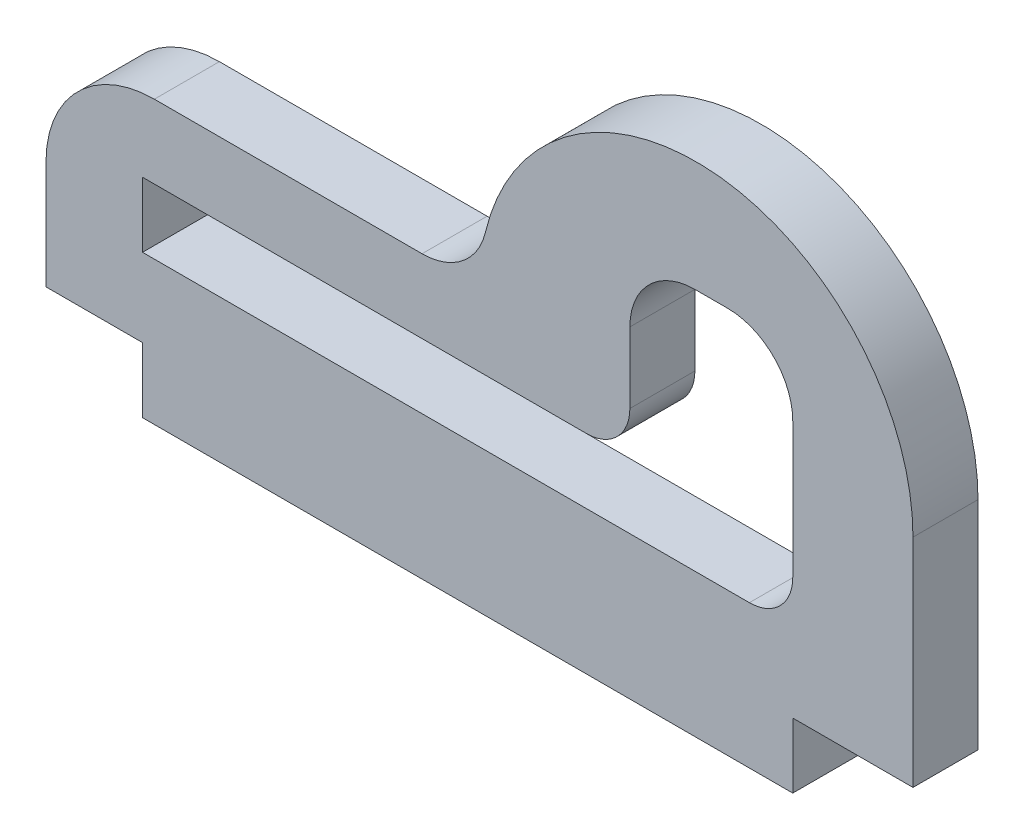
ISO-10303-21;
HEADER;
FILE_DESCRIPTION(('STEP AP214'),'2;1');
FILE_NAME('part.step','',(''),(''),'','','');
FILE_SCHEMA(('AUTOMOTIVE_DESIGN { 1 0 10303 214 1 1 1 1 }'));
ENDSEC;
DATA;
#1=APPLICATION_CONTEXT('core data for automotive mechanical design processes');
#2=APPLICATION_PROTOCOL_DEFINITION('international standard','automotive_design',2000,#1);
#3=PRODUCT_CONTEXT('',#1,'mechanical');
#4=PRODUCT('Part','Part','',(#3));
#5=PRODUCT_RELATED_PRODUCT_CATEGORY('part','',(#4));
#6=PRODUCT_DEFINITION_FORMATION('','',#4);
#7=PRODUCT_DEFINITION_CONTEXT('part definition',#1,'design');
#8=PRODUCT_DEFINITION('design','',#6,#7);
#9=PRODUCT_DEFINITION_SHAPE('','',#8);
#10=(LENGTH_UNIT() NAMED_UNIT(*) SI_UNIT(.MILLI.,.METRE.));
#11=(NAMED_UNIT(*) PLANE_ANGLE_UNIT() SI_UNIT($,.RADIAN.));
#12=(NAMED_UNIT(*) SI_UNIT($,.STERADIAN.) SOLID_ANGLE_UNIT());
#13=UNCERTAINTY_MEASURE_WITH_UNIT(LENGTH_MEASURE(1.E-05),#10,'distance_accuracy_value','');
#14=(GEOMETRIC_REPRESENTATION_CONTEXT(3) GLOBAL_UNCERTAINTY_ASSIGNED_CONTEXT((#13)) GLOBAL_UNIT_ASSIGNED_CONTEXT((#10,
#11,#12)) REPRESENTATION_CONTEXT('',''));
#15=CARTESIAN_POINT('',(0.,0.,0.));
#16=DIRECTION('',(0.,0.,1.));
#17=DIRECTION('',(1.,0.,0.));
#18=AXIS2_PLACEMENT_3D('',#15,#16,#17);
#19=CARTESIAN_POINT('',(10.,0.,3.));
#20=DIRECTION('',(0.,0.,1.));
#21=DIRECTION('',(1.,0.,0.));
#22=AXIS2_PLACEMENT_3D('',#19,#20,#21);
#23=PLANE('',#22);
#24=CARTESIAN_POINT('',(10.,0.,3.));
#25=DIRECTION('',(0.,0.,1.));
#26=DIRECTION('',(1.,0.,0.));
#27=AXIS2_PLACEMENT_3D('',#24,#25,#26);
#28=CIRCLE('',#27,10.);
#29=CARTESIAN_POINT('',(20.,0.,3.));
#30=VERTEX_POINT('',#29);
#31=CARTESIAN_POINT('',(0.269914891789601,2.30769230769231,3.));
#32=VERTEX_POINT('',#31);
#33=EDGE_CURVE('E291',#30,#32,#28,.T.);
#34=ORIENTED_EDGE('',*,*,#33,.T.);
#35=CARTESIAN_POINT('',(-2.64911064067352,3.,3.));
#36=DIRECTION('',(0.,0.,-1.));
#37=DIRECTION('',(1.,0.,0.));
#38=AXIS2_PLACEMENT_3D('',#35,#36,#37);
#39=CIRCLE('',#38,3.);
#40=CARTESIAN_POINT('',(-2.64911064067352,0.,3.));
#41=VERTEX_POINT('',#40);
#42=EDGE_CURVE('E295',#32,#41,#39,.T.);
#43=ORIENTED_EDGE('',*,*,#42,.T.);
#44=DIRECTION('',(-1.,0.,0.));
#45=VECTOR('',#44,1.);
#46=CARTESIAN_POINT('',(-2.64911064067352,0.,3.));
#47=LINE('',#46,#45);
#48=CARTESIAN_POINT('',(-15.,0.,3.));
#49=VERTEX_POINT('',#48);
#50=EDGE_CURVE('E299',#41,#49,#47,.T.);
#51=ORIENTED_EDGE('',*,*,#50,.T.);
#52=CARTESIAN_POINT('',(-15.,-5.,3.));
#53=DIRECTION('',(0.,0.,1.));
#54=DIRECTION('',(1.,0.,0.));
#55=AXIS2_PLACEMENT_3D('',#52,#53,#54);
#56=CIRCLE('',#55,5.);
#57=CARTESIAN_POINT('',(-20.,-5.00000000000004,3.));
#58=VERTEX_POINT('',#57);
#59=EDGE_CURVE('E302',#49,#58,#56,.T.);
#60=ORIENTED_EDGE('',*,*,#59,.T.);
#61=DIRECTION('',(0.,-1.,0.));
#62=VECTOR('',#61,1.);
#63=CARTESIAN_POINT('',(-20.,-5.00000000000004,3.));
#64=LINE('',#63,#62);
#65=CARTESIAN_POINT('',(-20.,-10.,3.));
#66=VERTEX_POINT('',#65);
#67=EDGE_CURVE('E305',#58,#66,#64,.T.);
#68=ORIENTED_EDGE('',*,*,#67,.T.);
#69=DIRECTION('',(1.,0.,0.));
#70=VECTOR('',#69,1.);
#71=CARTESIAN_POINT('',(-20.,-10.,3.));
#72=LINE('',#71,#70);
#73=CARTESIAN_POINT('',(-15.5468227424749,-10.,3.));
#74=VERTEX_POINT('',#73);
#75=EDGE_CURVE('E308',#66,#74,#72,.T.);
#76=ORIENTED_EDGE('',*,*,#75,.T.);
#77=DIRECTION('',(0.,-1.,0.));
#78=VECTOR('',#77,1.);
#79=CARTESIAN_POINT('',(-15.5468227424749,-10.,3.));
#80=LINE('',#79,#78);
#81=CARTESIAN_POINT('',(-15.5468227424749,-13.,3.));
#82=VERTEX_POINT('',#81);
#83=EDGE_CURVE('E311',#74,#82,#80,.T.);
#84=ORIENTED_EDGE('',*,*,#83,.T.);
#85=DIRECTION('',(1.,0.,0.));
#86=VECTOR('',#85,1.);
#87=CARTESIAN_POINT('',(-15.5468227424749,-13.,3.));
#88=LINE('',#87,#86);
#89=CARTESIAN_POINT('',(14.4531772575251,-13.,3.));
#90=VERTEX_POINT('',#89);
#91=EDGE_CURVE('E314',#82,#90,#88,.T.);
#92=ORIENTED_EDGE('',*,*,#91,.T.);
#93=DIRECTION('',(0.,1.,0.));
#94=VECTOR('',#93,1.);
#95=CARTESIAN_POINT('',(14.4531772575251,-10.,3.));
#96=LINE('',#95,#94);
#97=CARTESIAN_POINT('',(14.4531772575251,-10.,3.));
#98=VERTEX_POINT('',#97);
#99=EDGE_CURVE('E317',#90,#98,#96,.T.);
#100=ORIENTED_EDGE('',*,*,#99,.T.);
#101=DIRECTION('',(1.,0.,0.));
#102=VECTOR('',#101,1.);
#103=CARTESIAN_POINT('',(14.4531772575251,-10.,3.));
#104=LINE('',#103,#102);
#105=CARTESIAN_POINT('',(20.,-10.,3.));
#106=VERTEX_POINT('',#105);
#107=EDGE_CURVE('E320',#98,#106,#104,.T.);
#108=ORIENTED_EDGE('',*,*,#107,.T.);
#109=DIRECTION('',(0.,1.,0.));
#110=VECTOR('',#109,1.);
#111=CARTESIAN_POINT('',(20.,-10.,3.));
#112=LINE('',#111,#110);
#113=EDGE_CURVE('E323',#106,#30,#112,.T.);
#114=ORIENTED_EDGE('',*,*,#113,.T.);
#115=EDGE_LOOP('',(#34,#43,#51,#60,#68,#76,#84,#92,#100,#108,#114));
#116=FACE_BOUND('',#115,.T.);
#117=DIRECTION('',(-1.,0.,0.));
#118=VECTOR('',#117,1.);
#119=CARTESIAN_POINT('',(11.4531772575251,4.86956521739131,3.));
#120=LINE('',#119,#118);
#121=CARTESIAN_POINT('',(11.4531772575251,4.86956521739131,3.));
#122=VERTEX_POINT('',#121);
#123=CARTESIAN_POINT('',(9.93812709030103,4.86956521739131,3.));
#124=VERTEX_POINT('',#123);
#125=EDGE_CURVE('E203',#122,#124,#120,.T.);
#126=ORIENTED_EDGE('',*,*,#125,.F.);
#127=CARTESIAN_POINT('',(11.4531772575251,1.86956521739131,3.));
#128=DIRECTION('',(0.,0.,1.));
#129=DIRECTION('',(1.,0.,0.));
#130=AXIS2_PLACEMENT_3D('',#127,#128,#129);
#131=CIRCLE('',#130,3.);
#132=CARTESIAN_POINT('',(14.4531772575251,1.86956521739128,3.));
#133=VERTEX_POINT('',#132);
#134=EDGE_CURVE('E188',#133,#122,#131,.T.);
#135=ORIENTED_EDGE('',*,*,#134,.F.);
#136=DIRECTION('',(0.,1.,0.));
#137=VECTOR('',#136,1.);
#138=CARTESIAN_POINT('',(14.4531772575251,-3.39130434782609,3.));
#139=LINE('',#138,#137);
#140=CARTESIAN_POINT('',(14.4531772575251,-4.39130434782607,3.));
#141=VERTEX_POINT('',#140);
#142=EDGE_CURVE('E182',#141,#133,#139,.T.);
#143=ORIENTED_EDGE('',*,*,#142,.F.);
#144=CARTESIAN_POINT('',(12.4531772575251,-4.39130434782609,3.));
#145=DIRECTION('',(0.,0.,1.));
#146=DIRECTION('',(1.,0.,0.));
#147=AXIS2_PLACEMENT_3D('',#144,#145,#146);
#148=CIRCLE('',#147,2.);
#149=CARTESIAN_POINT('',(12.4531772575251,-6.39130434782609,3.));
#150=VERTEX_POINT('',#149);
#151=EDGE_CURVE('E227',#150,#141,#148,.T.);
#152=ORIENTED_EDGE('',*,*,#151,.F.);
#153=DIRECTION('',(1.,0.,0.));
#154=VECTOR('',#153,1.);
#155=CARTESIAN_POINT('',(-15.5468227424749,-6.39130434782609,3.));
#156=LINE('',#155,#154);
#157=CARTESIAN_POINT('',(-15.5468227424749,-6.39130434782609,3.));
#158=VERTEX_POINT('',#157);
#159=EDGE_CURVE('E224',#158,#150,#156,.T.);
#160=ORIENTED_EDGE('',*,*,#159,.F.);
#161=DIRECTION('',(0.,-1.,0.));
#162=VECTOR('',#161,1.);
#163=CARTESIAN_POINT('',(-15.5468227424749,-6.39130434782609,3.));
#164=LINE('',#163,#162);
#165=CARTESIAN_POINT('',(-15.5468227424749,-3.39130434782609,3.));
#166=VERTEX_POINT('',#165);
#167=EDGE_CURVE('E221',#166,#158,#164,.T.);
#168=ORIENTED_EDGE('',*,*,#167,.F.);
#169=DIRECTION('',(-1.,0.,0.));
#170=VECTOR('',#169,1.);
#171=CARTESIAN_POINT('',(-15.5468227424749,-3.39130434782609,3.));
#172=LINE('',#171,#170);
#173=CARTESIAN_POINT('',(4.93812709030099,-3.39130434782609,3.));
#174=VERTEX_POINT('',#173);
#175=EDGE_CURVE('E218',#174,#166,#172,.T.);
#176=ORIENTED_EDGE('',*,*,#175,.F.);
#177=CARTESIAN_POINT('',(4.938127090301,-1.39130434782609,3.));
#178=DIRECTION('',(0.,0.,-1.));
#179=DIRECTION('',(1.,0.,0.));
#180=AXIS2_PLACEMENT_3D('',#177,#178,#179);
#181=CIRCLE('',#180,2.);
#182=CARTESIAN_POINT('',(6.93812709030101,-1.39130434782609,3.));
#183=VERTEX_POINT('',#182);
#184=EDGE_CURVE('E215',#183,#174,#181,.T.);
#185=ORIENTED_EDGE('',*,*,#184,.F.);
#186=DIRECTION('',(0.,-1.,0.));
#187=VECTOR('',#186,1.);
#188=CARTESIAN_POINT('',(6.93812709030101,-1.39130434782607,3.));
#189=LINE('',#188,#187);
#190=CARTESIAN_POINT('',(6.93812709030101,1.86956521739128,3.));
#191=VERTEX_POINT('',#190);
#192=EDGE_CURVE('E212',#191,#183,#189,.T.);
#193=ORIENTED_EDGE('',*,*,#192,.F.);
#194=CARTESIAN_POINT('',(9.938127090301,1.86956521739131,3.));
#195=DIRECTION('',(0.,0.,1.));
#196=DIRECTION('',(-1.,0.,0.));
#197=AXIS2_PLACEMENT_3D('',#194,#195,#196);
#198=CIRCLE('',#197,3.);
#199=EDGE_CURVE('E207',#124,#191,#198,.T.);
#200=ORIENTED_EDGE('',*,*,#199,.F.);
#201=EDGE_LOOP('',(#126,#135,#143,#152,#160,#168,#176,#185,#193,#200));
#202=FACE_BOUND('',#201,.T.);
#203=ADVANCED_FACE('F41',(#116,#202),#23,.T.);
#204=CARTESIAN_POINT('',(10.,0.,0.));
#205=DIRECTION('',(0.,0.,1.));
#206=DIRECTION('',(1.,0.,0.));
#207=AXIS2_PLACEMENT_3D('',#204,#205,#206);
#208=PLANE('',#207);
#209=CARTESIAN_POINT('',(10.,0.,0.));
#210=DIRECTION('',(0.,0.,1.));
#211=DIRECTION('',(1.,0.,0.));
#212=AXIS2_PLACEMENT_3D('',#209,#210,#211);
#213=CIRCLE('',#212,10.);
#214=CARTESIAN_POINT('',(20.,0.,0.));
#215=VERTEX_POINT('',#214);
#216=CARTESIAN_POINT('',(0.269914891789601,2.30769230769231,0.));
#217=VERTEX_POINT('',#216);
#218=EDGE_CURVE('E198',#215,#217,#213,.T.);
#219=ORIENTED_EDGE('',*,*,#218,.F.);
#220=DIRECTION('',(0.,1.,0.));
#221=VECTOR('',#220,1.);
#222=CARTESIAN_POINT('',(20.,-10.,0.));
#223=LINE('',#222,#221);
#224=CARTESIAN_POINT('',(20.,-10.,0.));
#225=VERTEX_POINT('',#224);
#226=EDGE_CURVE('E296',#225,#215,#223,.T.);
#227=ORIENTED_EDGE('',*,*,#226,.F.);
#228=DIRECTION('',(1.,0.,0.));
#229=VECTOR('',#228,1.);
#230=CARTESIAN_POINT('',(14.4531772575251,-10.,0.));
#231=LINE('',#230,#229);
#232=CARTESIAN_POINT('',(14.4531772575251,-10.,0.));
#233=VERTEX_POINT('',#232);
#234=EDGE_CURVE('E354',#233,#225,#231,.T.);
#235=ORIENTED_EDGE('',*,*,#234,.F.);
#236=DIRECTION('',(0.,1.,0.));
#237=VECTOR('',#236,1.);
#238=CARTESIAN_POINT('',(14.4531772575251,-10.,0.));
#239=LINE('',#238,#237);
#240=CARTESIAN_POINT('',(14.4531772575251,-13.,0.));
#241=VERTEX_POINT('',#240);
#242=EDGE_CURVE('E351',#241,#233,#239,.T.);
#243=ORIENTED_EDGE('',*,*,#242,.F.);
#244=DIRECTION('',(1.,0.,0.));
#245=VECTOR('',#244,1.);
#246=CARTESIAN_POINT('',(-15.5468227424749,-13.,0.));
#247=LINE('',#246,#245);
#248=CARTESIAN_POINT('',(-15.5468227424749,-13.,0.));
#249=VERTEX_POINT('',#248);
#250=EDGE_CURVE('E348',#249,#241,#247,.T.);
#251=ORIENTED_EDGE('',*,*,#250,.F.);
#252=DIRECTION('',(0.,-1.,0.));
#253=VECTOR('',#252,1.);
#254=CARTESIAN_POINT('',(-15.5468227424749,-10.,0.));
#255=LINE('',#254,#253);
#256=CARTESIAN_POINT('',(-15.5468227424749,-10.,0.));
#257=VERTEX_POINT('',#256);
#258=EDGE_CURVE('E345',#257,#249,#255,.T.);
#259=ORIENTED_EDGE('',*,*,#258,.F.);
#260=DIRECTION('',(1.,0.,0.));
#261=VECTOR('',#260,1.);
#262=CARTESIAN_POINT('',(-20.,-10.,0.));
#263=LINE('',#262,#261);
#264=CARTESIAN_POINT('',(-20.,-10.,0.));
#265=VERTEX_POINT('',#264);
#266=EDGE_CURVE('E342',#265,#257,#263,.T.);
#267=ORIENTED_EDGE('',*,*,#266,.F.);
#268=DIRECTION('',(0.,-1.,0.));
#269=VECTOR('',#268,1.);
#270=CARTESIAN_POINT('',(-20.,-5.00000000000004,0.));
#271=LINE('',#270,#269);
#272=CARTESIAN_POINT('',(-20.,-5.00000000000004,0.));
#273=VERTEX_POINT('',#272);
#274=EDGE_CURVE('E339',#273,#265,#271,.T.);
#275=ORIENTED_EDGE('',*,*,#274,.F.);
#276=CARTESIAN_POINT('',(-15.,-5.,0.));
#277=DIRECTION('',(0.,0.,1.));
#278=DIRECTION('',(1.,0.,0.));
#279=AXIS2_PLACEMENT_3D('',#276,#277,#278);
#280=CIRCLE('',#279,5.);
#281=CARTESIAN_POINT('',(-15.,0.,0.));
#282=VERTEX_POINT('',#281);
#283=EDGE_CURVE('E336',#282,#273,#280,.T.);
#284=ORIENTED_EDGE('',*,*,#283,.F.);
#285=DIRECTION('',(-1.,0.,0.));
#286=VECTOR('',#285,1.);
#287=CARTESIAN_POINT('',(-2.64911064067352,0.,0.));
#288=LINE('',#287,#286);
#289=CARTESIAN_POINT('',(-2.64911064067352,0.,0.));
#290=VERTEX_POINT('',#289);
#291=EDGE_CURVE('E333',#290,#282,#288,.T.);
#292=ORIENTED_EDGE('',*,*,#291,.F.);
#293=CARTESIAN_POINT('',(-2.64911064067352,3.,0.));
#294=DIRECTION('',(0.,0.,-1.));
#295=DIRECTION('',(1.,0.,0.));
#296=AXIS2_PLACEMENT_3D('',#293,#294,#295);
#297=CIRCLE('',#296,3.);
#298=EDGE_CURVE('E330',#217,#290,#297,.T.);
#299=ORIENTED_EDGE('',*,*,#298,.F.);
#300=EDGE_LOOP('',(#219,#227,#235,#243,#251,#259,#267,#275,#284,#292,#299));
#301=FACE_BOUND('',#300,.T.);
#302=CARTESIAN_POINT('',(11.4531772575251,1.86956521739131,0.));
#303=DIRECTION('',(0.,0.,1.));
#304=DIRECTION('',(1.,0.,0.));
#305=AXIS2_PLACEMENT_3D('',#302,#303,#304);
#306=CIRCLE('',#305,3.);
#307=CARTESIAN_POINT('',(14.4531772575251,1.86956521739128,0.));
#308=VERTEX_POINT('',#307);
#309=CARTESIAN_POINT('',(11.4531772575251,4.86956521739131,0.));
#310=VERTEX_POINT('',#309);
#311=EDGE_CURVE('E195',#308,#310,#306,.T.);
#312=ORIENTED_EDGE('',*,*,#311,.T.);
#313=DIRECTION('',(-1.,0.,0.));
#314=VECTOR('',#313,1.);
#315=CARTESIAN_POINT('',(11.4531772575251,4.86956521739131,0.));
#316=LINE('',#315,#314);
#317=CARTESIAN_POINT('',(9.93812709030103,4.86956521739131,0.));
#318=VERTEX_POINT('',#317);
#319=EDGE_CURVE('E232',#310,#318,#316,.T.);
#320=ORIENTED_EDGE('',*,*,#319,.T.);
#321=CARTESIAN_POINT('',(9.938127090301,1.86956521739131,0.));
#322=DIRECTION('',(0.,0.,1.));
#323=DIRECTION('',(-1.,0.,0.));
#324=AXIS2_PLACEMENT_3D('',#321,#322,#323);
#325=CIRCLE('',#324,3.);
#326=CARTESIAN_POINT('',(6.93812709030101,1.86956521739128,0.));
#327=VERTEX_POINT('',#326);
#328=EDGE_CURVE('E236',#318,#327,#325,.T.);
#329=ORIENTED_EDGE('',*,*,#328,.T.);
#330=DIRECTION('',(0.,-1.,0.));
#331=VECTOR('',#330,1.);
#332=CARTESIAN_POINT('',(6.93812709030101,-1.39130434782607,0.));
#333=LINE('',#332,#331);
#334=CARTESIAN_POINT('',(6.93812709030101,-1.39130434782609,0.));
#335=VERTEX_POINT('',#334);
#336=EDGE_CURVE('E240',#327,#335,#333,.T.);
#337=ORIENTED_EDGE('',*,*,#336,.T.);
#338=CARTESIAN_POINT('',(4.938127090301,-1.39130434782609,0.));
#339=DIRECTION('',(0.,0.,-1.));
#340=DIRECTION('',(1.,0.,0.));
#341=AXIS2_PLACEMENT_3D('',#338,#339,#340);
#342=CIRCLE('',#341,2.);
#343=CARTESIAN_POINT('',(4.93812709030099,-3.39130434782609,0.));
#344=VERTEX_POINT('',#343);
#345=EDGE_CURVE('E244',#335,#344,#342,.T.);
#346=ORIENTED_EDGE('',*,*,#345,.T.);
#347=DIRECTION('',(-1.,0.,0.));
#348=VECTOR('',#347,1.);
#349=CARTESIAN_POINT('',(-15.5468227424749,-3.39130434782609,0.));
#350=LINE('',#349,#348);
#351=CARTESIAN_POINT('',(-15.5468227424749,-3.39130434782609,0.));
#352=VERTEX_POINT('',#351);
#353=EDGE_CURVE('E248',#344,#352,#350,.T.);
#354=ORIENTED_EDGE('',*,*,#353,.T.);
#355=DIRECTION('',(0.,-1.,0.));
#356=VECTOR('',#355,1.);
#357=CARTESIAN_POINT('',(-15.5468227424749,-6.39130434782609,0.));
#358=LINE('',#357,#356);
#359=CARTESIAN_POINT('',(-15.5468227424749,-6.39130434782609,0.));
#360=VERTEX_POINT('',#359);
#361=EDGE_CURVE('E252',#352,#360,#358,.T.);
#362=ORIENTED_EDGE('',*,*,#361,.T.);
#363=DIRECTION('',(1.,0.,0.));
#364=VECTOR('',#363,1.);
#365=CARTESIAN_POINT('',(-15.5468227424749,-6.39130434782609,0.));
#366=LINE('',#365,#364);
#367=CARTESIAN_POINT('',(12.4531772575251,-6.39130434782609,0.));
#368=VERTEX_POINT('',#367);
#369=EDGE_CURVE('E256',#360,#368,#366,.T.);
#370=ORIENTED_EDGE('',*,*,#369,.T.);
#371=CARTESIAN_POINT('',(12.4531772575251,-4.39130434782609,0.));
#372=DIRECTION('',(0.,0.,1.));
#373=DIRECTION('',(1.,0.,0.));
#374=AXIS2_PLACEMENT_3D('',#371,#372,#373);
#375=CIRCLE('',#374,2.);
#376=CARTESIAN_POINT('',(14.4531772575251,-4.39130434782607,0.));
#377=VERTEX_POINT('',#376);
#378=EDGE_CURVE('E260',#368,#377,#375,.T.);
#379=ORIENTED_EDGE('',*,*,#378,.T.);
#380=DIRECTION('',(0.,1.,0.));
#381=VECTOR('',#380,1.);
#382=CARTESIAN_POINT('',(14.4531772575251,-4.39130434782607,0.));
#383=LINE('',#382,#381);
#384=EDGE_CURVE('E189',#377,#308,#383,.T.);
#385=ORIENTED_EDGE('',*,*,#384,.T.);
#386=EDGE_LOOP('',(#312,#320,#329,#337,#346,#354,#362,#370,#379,#385));
#387=FACE_BOUND('',#386,.T.);
#388=ADVANCED_FACE('F405',(#301,#387),#208,.F.);
#389=CARTESIAN_POINT('',(10.,0.,3.));
#390=DIRECTION('',(0.,0.,-1.));
#391=DIRECTION('',(-1.,0.,0.));
#392=AXIS2_PLACEMENT_3D('',#389,#390,#391);
#393=CYLINDRICAL_SURFACE('',#392,10.);
#394=ORIENTED_EDGE('',*,*,#218,.T.);
#395=DIRECTION('',(0.,0.,-1.));
#396=VECTOR('',#395,1.);
#397=CARTESIAN_POINT('',(0.269914891789601,2.30769230769231,3.));
#398=LINE('',#397,#396);
#399=EDGE_CURVE('E11',#32,#217,#398,.T.);
#400=ORIENTED_EDGE('',*,*,#399,.F.);
#401=ORIENTED_EDGE('',*,*,#33,.F.);
#402=DIRECTION('',(0.,0.,-1.));
#403=VECTOR('',#402,1.);
#404=CARTESIAN_POINT('',(20.,0.,3.));
#405=LINE('',#404,#403);
#406=EDGE_CURVE('E326',#30,#215,#405,.T.);
#407=ORIENTED_EDGE('',*,*,#406,.T.);
#408=EDGE_LOOP('',(#394,#400,#401,#407));
#409=FACE_BOUND('',#408,.T.);
#410=ADVANCED_FACE('F43',(#409),#393,.T.);
#411=CARTESIAN_POINT('',(-2.64911064067352,3.,3.));
#412=DIRECTION('',(0.,0.,-1.));
#413=DIRECTION('',(-1.,0.,0.));
#414=AXIS2_PLACEMENT_3D('',#411,#412,#413);
#415=CYLINDRICAL_SURFACE('',#414,3.);
#416=ORIENTED_EDGE('',*,*,#298,.T.);
#417=DIRECTION('',(0.,0.,-1.));
#418=VECTOR('',#417,1.);
#419=CARTESIAN_POINT('',(-2.64911064067352,0.,3.));
#420=LINE('',#419,#418);
#421=EDGE_CURVE('E50',#41,#290,#420,.T.);
#422=ORIENTED_EDGE('',*,*,#421,.F.);
#423=ORIENTED_EDGE('',*,*,#42,.F.);
#424=ORIENTED_EDGE('',*,*,#399,.T.);
#425=EDGE_LOOP('',(#416,#422,#423,#424));
#426=FACE_BOUND('',#425,.T.);
#427=ADVANCED_FACE('F422',(#426),#415,.F.);
#428=CARTESIAN_POINT('',(-2.64911064067352,0.,3.));
#429=DIRECTION('',(0.,-1.,0.));
#430=DIRECTION('',(1.,0.,0.));
#431=AXIS2_PLACEMENT_3D('',#428,#429,#430);
#432=PLANE('',#431);
#433=ORIENTED_EDGE('',*,*,#291,.T.);
#434=DIRECTION('',(0.,0.,-1.));
#435=VECTOR('',#434,1.);
#436=CARTESIAN_POINT('',(-15.,0.,3.));
#437=LINE('',#436,#435);
#438=EDGE_CURVE('E390',#49,#282,#437,.T.);
#439=ORIENTED_EDGE('',*,*,#438,.F.);
#440=ORIENTED_EDGE('',*,*,#50,.F.);
#441=ORIENTED_EDGE('',*,*,#421,.T.);
#442=EDGE_LOOP('',(#433,#439,#440,#441));
#443=FACE_BOUND('',#442,.T.);
#444=ADVANCED_FACE('F399',(#443),#432,.F.);
#445=CARTESIAN_POINT('',(-15.,-5.,3.));
#446=DIRECTION('',(0.,0.,-1.));
#447=DIRECTION('',(-1.,0.,0.));
#448=AXIS2_PLACEMENT_3D('',#445,#446,#447);
#449=CYLINDRICAL_SURFACE('',#448,5.);
#450=ORIENTED_EDGE('',*,*,#283,.T.);
#451=DIRECTION('',(0.,0.,-1.));
#452=VECTOR('',#451,1.);
#453=CARTESIAN_POINT('',(-20.,-5.00000000000004,3.));
#454=LINE('',#453,#452);
#455=EDGE_CURVE('E386',#58,#273,#454,.T.);
#456=ORIENTED_EDGE('',*,*,#455,.F.);
#457=ORIENTED_EDGE('',*,*,#59,.F.);
#458=ORIENTED_EDGE('',*,*,#438,.T.);
#459=EDGE_LOOP('',(#450,#456,#457,#458));
#460=FACE_BOUND('',#459,.T.);
#461=ADVANCED_FACE('F411',(#460),#449,.T.);
#462=CARTESIAN_POINT('',(-20.,-5.00000000000004,3.));
#463=DIRECTION('',(1.,0.,0.));
#464=DIRECTION('',(0.,0.,-1.));
#465=AXIS2_PLACEMENT_3D('',#462,#463,#464);
#466=PLANE('',#465);
#467=ORIENTED_EDGE('',*,*,#274,.T.);
#468=DIRECTION('',(0.,0.,-1.));
#469=VECTOR('',#468,1.);
#470=CARTESIAN_POINT('',(-20.,-10.,3.));
#471=LINE('',#470,#469);
#472=EDGE_CURVE('E382',#66,#265,#471,.T.);
#473=ORIENTED_EDGE('',*,*,#472,.F.);
#474=ORIENTED_EDGE('',*,*,#67,.F.);
#475=ORIENTED_EDGE('',*,*,#455,.T.);
#476=EDGE_LOOP('',(#467,#473,#474,#475));
#477=FACE_BOUND('',#476,.T.);
#478=ADVANCED_FACE('F415',(#477),#466,.F.);
#479=CARTESIAN_POINT('',(-20.,-10.,3.));
#480=DIRECTION('',(0.,1.,0.));
#481=DIRECTION('',(0.,0.,1.));
#482=AXIS2_PLACEMENT_3D('',#479,#480,#481);
#483=PLANE('',#482);
#484=ORIENTED_EDGE('',*,*,#266,.T.);
#485=DIRECTION('',(0.,0.,-1.));
#486=VECTOR('',#485,1.);
#487=CARTESIAN_POINT('',(-15.5468227424749,-10.,3.));
#488=LINE('',#487,#486);
#489=EDGE_CURVE('E378',#74,#257,#488,.T.);
#490=ORIENTED_EDGE('',*,*,#489,.F.);
#491=ORIENTED_EDGE('',*,*,#75,.F.);
#492=ORIENTED_EDGE('',*,*,#472,.T.);
#493=EDGE_LOOP('',(#484,#490,#491,#492));
#494=FACE_BOUND('',#493,.T.);
#495=ADVANCED_FACE('F450',(#494),#483,.F.);
#496=CARTESIAN_POINT('',(-15.5468227424749,-10.,3.));
#497=DIRECTION('',(1.,0.,0.));
#498=DIRECTION('',(0.,0.,-1.));
#499=AXIS2_PLACEMENT_3D('',#496,#497,#498);
#500=PLANE('',#499);
#501=ORIENTED_EDGE('',*,*,#258,.T.);
#502=DIRECTION('',(0.,0.,-1.));
#503=VECTOR('',#502,1.);
#504=CARTESIAN_POINT('',(-15.5468227424749,-13.,3.));
#505=LINE('',#504,#503);
#506=EDGE_CURVE('E374',#82,#249,#505,.T.);
#507=ORIENTED_EDGE('',*,*,#506,.F.);
#508=ORIENTED_EDGE('',*,*,#83,.F.);
#509=ORIENTED_EDGE('',*,*,#489,.T.);
#510=EDGE_LOOP('',(#501,#507,#508,#509));
#511=FACE_BOUND('',#510,.T.);
#512=ADVANCED_FACE('F448',(#511),#500,.F.);
#513=CARTESIAN_POINT('',(-15.5468227424749,-13.,3.));
#514=DIRECTION('',(0.,1.,0.));
#515=DIRECTION('',(0.,0.,1.));
#516=AXIS2_PLACEMENT_3D('',#513,#514,#515);
#517=PLANE('',#516);
#518=ORIENTED_EDGE('',*,*,#250,.T.);
#519=DIRECTION('',(0.,0.,-1.));
#520=VECTOR('',#519,1.);
#521=CARTESIAN_POINT('',(14.4531772575251,-13.,3.));
#522=LINE('',#521,#520);
#523=EDGE_CURVE('E370',#90,#241,#522,.T.);
#524=ORIENTED_EDGE('',*,*,#523,.F.);
#525=ORIENTED_EDGE('',*,*,#91,.F.);
#526=ORIENTED_EDGE('',*,*,#506,.T.);
#527=EDGE_LOOP('',(#518,#524,#525,#526));
#528=FACE_BOUND('',#527,.T.);
#529=ADVANCED_FACE('F443',(#528),#517,.F.);
#530=CARTESIAN_POINT('',(14.4531772575251,-10.,3.));
#531=DIRECTION('',(-1.,0.,0.));
#532=DIRECTION('',(0.,0.,1.));
#533=AXIS2_PLACEMENT_3D('',#530,#531,#532);
#534=PLANE('',#533);
#535=ORIENTED_EDGE('',*,*,#242,.T.);
#536=DIRECTION('',(0.,0.,-1.));
#537=VECTOR('',#536,1.);
#538=CARTESIAN_POINT('',(14.4531772575251,-10.,3.));
#539=LINE('',#538,#537);
#540=EDGE_CURVE('E366',#98,#233,#539,.T.);
#541=ORIENTED_EDGE('',*,*,#540,.F.);
#542=ORIENTED_EDGE('',*,*,#99,.F.);
#543=ORIENTED_EDGE('',*,*,#523,.T.);
#544=EDGE_LOOP('',(#535,#541,#542,#543));
#545=FACE_BOUND('',#544,.T.);
#546=ADVANCED_FACE('F438',(#545),#534,.F.);
#547=CARTESIAN_POINT('',(14.4531772575251,-10.,3.));
#548=DIRECTION('',(0.,1.,0.));
#549=DIRECTION('',(0.,0.,1.));
#550=AXIS2_PLACEMENT_3D('',#547,#548,#549);
#551=PLANE('',#550);
#552=ORIENTED_EDGE('',*,*,#234,.T.);
#553=DIRECTION('',(0.,0.,-1.));
#554=VECTOR('',#553,1.);
#555=CARTESIAN_POINT('',(20.,-10.,3.));
#556=LINE('',#555,#554);
#557=EDGE_CURVE('E362',#106,#225,#556,.T.);
#558=ORIENTED_EDGE('',*,*,#557,.F.);
#559=ORIENTED_EDGE('',*,*,#107,.F.);
#560=ORIENTED_EDGE('',*,*,#540,.T.);
#561=EDGE_LOOP('',(#552,#558,#559,#560));
#562=FACE_BOUND('',#561,.T.);
#563=ADVANCED_FACE('F434',(#562),#551,.F.);
#564=CARTESIAN_POINT('',(20.,-10.,3.));
#565=DIRECTION('',(-1.,0.,0.));
#566=DIRECTION('',(0.,-1.,0.));
#567=AXIS2_PLACEMENT_3D('',#564,#565,#566);
#568=PLANE('',#567);
#569=ORIENTED_EDGE('',*,*,#226,.T.);
#570=ORIENTED_EDGE('',*,*,#406,.F.);
#571=ORIENTED_EDGE('',*,*,#113,.F.);
#572=ORIENTED_EDGE('',*,*,#557,.T.);
#573=EDGE_LOOP('',(#569,#570,#571,#572));
#574=FACE_BOUND('',#573,.T.);
#575=ADVANCED_FACE('F429',(#574),#568,.F.);
#576=CARTESIAN_POINT('',(11.4531772575251,1.86956521739131,3.));
#577=DIRECTION('',(0.,0.,-1.));
#578=DIRECTION('',(-1.,0.,0.));
#579=AXIS2_PLACEMENT_3D('',#576,#577,#578);
#580=CYLINDRICAL_SURFACE('',#579,3.);
#581=ORIENTED_EDGE('',*,*,#311,.F.);
#582=DIRECTION('',(0.,0.,-1.));
#583=VECTOR('',#582,1.);
#584=CARTESIAN_POINT('',(14.4531772575251,1.86956521739128,3.));
#585=LINE('',#584,#583);
#586=EDGE_CURVE('E62',#133,#308,#585,.T.);
#587=ORIENTED_EDGE('',*,*,#586,.F.);
#588=ORIENTED_EDGE('',*,*,#134,.T.);
#589=DIRECTION('',(0.,0.,-1.));
#590=VECTOR('',#589,1.);
#591=CARTESIAN_POINT('',(11.4531772575251,4.86956521739131,3.));
#592=LINE('',#591,#590);
#593=EDGE_CURVE('E199',#122,#310,#592,.T.);
#594=ORIENTED_EDGE('',*,*,#593,.T.);
#595=EDGE_LOOP('',(#581,#587,#588,#594));
#596=FACE_BOUND('',#595,.T.);
#597=ADVANCED_FACE('F192',(#596),#580,.F.);
#598=CARTESIAN_POINT('',(11.4531772575251,4.86956521739131,3.));
#599=DIRECTION('',(0.,-1.,0.));
#600=DIRECTION('',(0.,0.,-1.));
#601=AXIS2_PLACEMENT_3D('',#598,#599,#600);
#602=PLANE('',#601);
#603=ORIENTED_EDGE('',*,*,#319,.F.);
#604=ORIENTED_EDGE('',*,*,#593,.F.);
#605=ORIENTED_EDGE('',*,*,#125,.T.);
#606=DIRECTION('',(0.,0.,-1.));
#607=VECTOR('',#606,1.);
#608=CARTESIAN_POINT('',(9.93812709030103,4.86956521739131,3.));
#609=LINE('',#608,#607);
#610=EDGE_CURVE('E286',#124,#318,#609,.T.);
#611=ORIENTED_EDGE('',*,*,#610,.T.);
#612=EDGE_LOOP('',(#603,#604,#605,#611));
#613=FACE_BOUND('',#612,.T.);
#614=ADVANCED_FACE('F497',(#613),#602,.T.);
#615=CARTESIAN_POINT('',(9.938127090301,1.86956521739131,3.));
#616=DIRECTION('',(0.,0.,-1.));
#617=DIRECTION('',(-1.,0.,0.));
#618=AXIS2_PLACEMENT_3D('',#615,#616,#617);
#619=CYLINDRICAL_SURFACE('',#618,3.);
#620=ORIENTED_EDGE('',*,*,#328,.F.);
#621=ORIENTED_EDGE('',*,*,#610,.F.);
#622=ORIENTED_EDGE('',*,*,#199,.T.);
#623=DIRECTION('',(0.,0.,-1.));
#624=VECTOR('',#623,1.);
#625=CARTESIAN_POINT('',(6.93812709030101,1.86956521739128,3.));
#626=LINE('',#625,#624);
#627=EDGE_CURVE('E283',#191,#327,#626,.T.);
#628=ORIENTED_EDGE('',*,*,#627,.T.);
#629=EDGE_LOOP('',(#620,#621,#622,#628));
#630=FACE_BOUND('',#629,.T.);
#631=ADVANCED_FACE('F503',(#630),#619,.F.);
#632=CARTESIAN_POINT('',(6.93812709030101,-1.39130434782607,3.));
#633=DIRECTION('',(1.,0.,0.));
#634=DIRECTION('',(0.,0.,-1.));
#635=AXIS2_PLACEMENT_3D('',#632,#633,#634);
#636=PLANE('',#635);
#637=ORIENTED_EDGE('',*,*,#336,.F.);
#638=ORIENTED_EDGE('',*,*,#627,.F.);
#639=ORIENTED_EDGE('',*,*,#192,.T.);
#640=DIRECTION('',(0.,0.,-1.));
#641=VECTOR('',#640,1.);
#642=CARTESIAN_POINT('',(6.93812709030101,-1.39130434782609,3.));
#643=LINE('',#642,#641);
#644=EDGE_CURVE('E280',#183,#335,#643,.T.);
#645=ORIENTED_EDGE('',*,*,#644,.T.);
#646=EDGE_LOOP('',(#637,#638,#639,#645));
#647=FACE_BOUND('',#646,.T.);
#648=ADVANCED_FACE('F510',(#647),#636,.T.);
#649=CARTESIAN_POINT('',(4.938127090301,-1.39130434782609,3.));
#650=DIRECTION('',(0.,0.,-1.));
#651=DIRECTION('',(-1.,0.,0.));
#652=AXIS2_PLACEMENT_3D('',#649,#650,#651);
#653=CYLINDRICAL_SURFACE('',#652,2.);
#654=ORIENTED_EDGE('',*,*,#345,.F.);
#655=ORIENTED_EDGE('',*,*,#644,.F.);
#656=ORIENTED_EDGE('',*,*,#184,.T.);
#657=DIRECTION('',(0.,0.,-1.));
#658=VECTOR('',#657,1.);
#659=CARTESIAN_POINT('',(4.93812709030099,-3.39130434782609,3.));
#660=LINE('',#659,#658);
#661=EDGE_CURVE('E277',#174,#344,#660,.T.);
#662=ORIENTED_EDGE('',*,*,#661,.T.);
#663=EDGE_LOOP('',(#654,#655,#656,#662));
#664=FACE_BOUND('',#663,.T.);
#665=ADVANCED_FACE('F518',(#664),#653,.T.);
#666=CARTESIAN_POINT('',(-15.5468227424749,-3.39130434782609,3.));
#667=DIRECTION('',(0.,-1.,0.));
#668=DIRECTION('',(0.,0.,-1.));
#669=AXIS2_PLACEMENT_3D('',#666,#667,#668);
#670=PLANE('',#669);
#671=ORIENTED_EDGE('',*,*,#353,.F.);
#672=ORIENTED_EDGE('',*,*,#661,.F.);
#673=ORIENTED_EDGE('',*,*,#175,.T.);
#674=DIRECTION('',(0.,0.,-1.));
#675=VECTOR('',#674,1.);
#676=CARTESIAN_POINT('',(-15.5468227424749,-3.39130434782609,3.));
#677=LINE('',#676,#675);
#678=EDGE_CURVE('E274',#166,#352,#677,.T.);
#679=ORIENTED_EDGE('',*,*,#678,.T.);
#680=EDGE_LOOP('',(#671,#672,#673,#679));
#681=FACE_BOUND('',#680,.T.);
#682=ADVANCED_FACE('F526',(#681),#670,.T.);
#683=CARTESIAN_POINT('',(-15.5468227424749,-6.39130434782609,3.));
#684=DIRECTION('',(1.,0.,0.));
#685=DIRECTION('',(0.,0.,-1.));
#686=AXIS2_PLACEMENT_3D('',#683,#684,#685);
#687=PLANE('',#686);
#688=ORIENTED_EDGE('',*,*,#361,.F.);
#689=ORIENTED_EDGE('',*,*,#678,.F.);
#690=ORIENTED_EDGE('',*,*,#167,.T.);
#691=DIRECTION('',(0.,0.,-1.));
#692=VECTOR('',#691,1.);
#693=CARTESIAN_POINT('',(-15.5468227424749,-6.39130434782609,3.));
#694=LINE('',#693,#692);
#695=EDGE_CURVE('E271',#158,#360,#694,.T.);
#696=ORIENTED_EDGE('',*,*,#695,.T.);
#697=EDGE_LOOP('',(#688,#689,#690,#696));
#698=FACE_BOUND('',#697,.T.);
#699=ADVANCED_FACE('F534',(#698),#687,.T.);
#700=CARTESIAN_POINT('',(-15.5468227424749,-6.39130434782609,3.));
#701=DIRECTION('',(0.,1.,0.));
#702=DIRECTION('',(0.,0.,1.));
#703=AXIS2_PLACEMENT_3D('',#700,#701,#702);
#704=PLANE('',#703);
#705=ORIENTED_EDGE('',*,*,#369,.F.);
#706=ORIENTED_EDGE('',*,*,#695,.F.);
#707=ORIENTED_EDGE('',*,*,#159,.T.);
#708=DIRECTION('',(0.,0.,-1.));
#709=VECTOR('',#708,1.);
#710=CARTESIAN_POINT('',(12.4531772575251,-6.39130434782609,3.));
#711=LINE('',#710,#709);
#712=EDGE_CURVE('E268',#150,#368,#711,.T.);
#713=ORIENTED_EDGE('',*,*,#712,.T.);
#714=EDGE_LOOP('',(#705,#706,#707,#713));
#715=FACE_BOUND('',#714,.T.);
#716=ADVANCED_FACE('F542',(#715),#704,.T.);
#717=CARTESIAN_POINT('',(12.4531772575251,-4.39130434782609,3.));
#718=DIRECTION('',(0.,0.,-1.));
#719=DIRECTION('',(-1.,0.,0.));
#720=AXIS2_PLACEMENT_3D('',#717,#718,#719);
#721=CYLINDRICAL_SURFACE('',#720,2.);
#722=ORIENTED_EDGE('',*,*,#378,.F.);
#723=ORIENTED_EDGE('',*,*,#712,.F.);
#724=ORIENTED_EDGE('',*,*,#151,.T.);
#725=DIRECTION('',(0.,0.,-1.));
#726=VECTOR('',#725,1.);
#727=CARTESIAN_POINT('',(14.4531772575251,-4.39130434782607,3.));
#728=LINE('',#727,#726);
#729=EDGE_CURVE('E57',#141,#377,#728,.T.);
#730=ORIENTED_EDGE('',*,*,#729,.T.);
#731=EDGE_LOOP('',(#722,#723,#724,#730));
#732=FACE_BOUND('',#731,.T.);
#733=ADVANCED_FACE('F550',(#732),#721,.F.);
#734=CARTESIAN_POINT('',(14.4531772575251,-4.39130434782607,3.));
#735=DIRECTION('',(-1.,0.,0.));
#736=DIRECTION('',(0.,0.,1.));
#737=AXIS2_PLACEMENT_3D('',#734,#735,#736);
#738=PLANE('',#737);
#739=ORIENTED_EDGE('',*,*,#384,.F.);
#740=ORIENTED_EDGE('',*,*,#729,.F.);
#741=ORIENTED_EDGE('',*,*,#142,.T.);
#742=ORIENTED_EDGE('',*,*,#586,.T.);
#743=EDGE_LOOP('',(#739,#740,#741,#742));
#744=FACE_BOUND('',#743,.T.);
#745=ADVANCED_FACE('F183',(#744),#738,.T.);
#746=CLOSED_SHELL('',(#203,#388,#410,#427,#444,#461,#478,#495,#512,#529,#546,#563,#575,#597,
#614,#631,#648,#665,#682,#699,#716,#733,#745));
#747=MANIFOLD_SOLID_BREP('B2',#746);
#748=ADVANCED_BREP_SHAPE_REPRESENTATION('',(#18,#747),#14);
#749=SHAPE_DEFINITION_REPRESENTATION(#9,#748);
ENDSEC;
END-ISO-10303-21;
